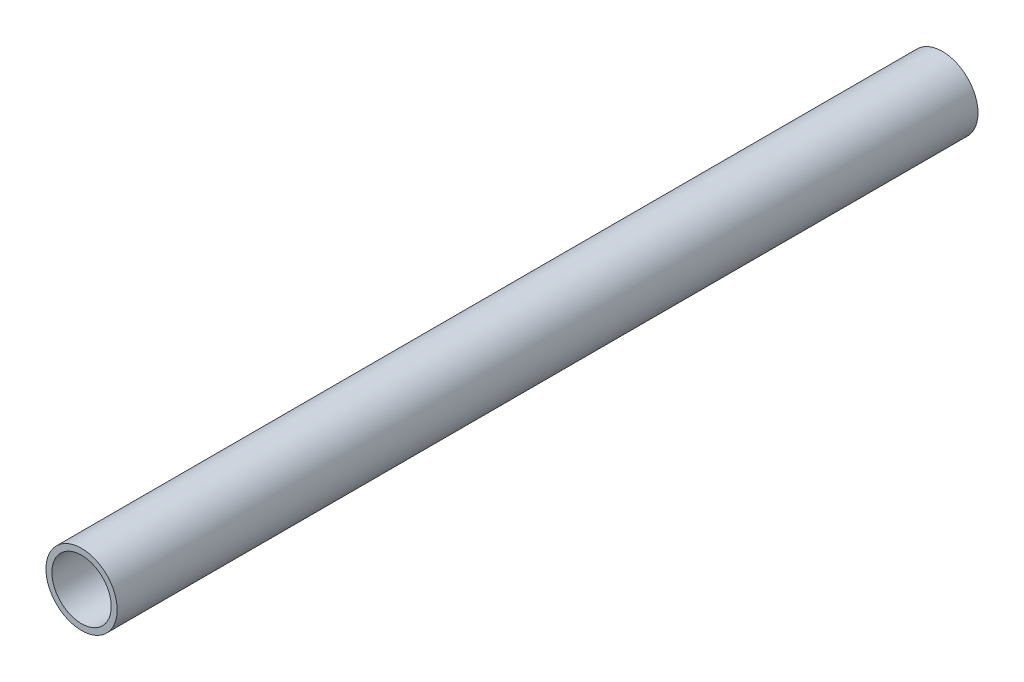
ISO-10303-21;
HEADER;
FILE_DESCRIPTION(('STEP AP214'),'2;1');
FILE_NAME('part.step','',(''),(''),'','','');
FILE_SCHEMA(('AUTOMOTIVE_DESIGN { 1 0 10303 214 1 1 1 1 }'));
ENDSEC;
DATA;
#1=APPLICATION_CONTEXT('core data for automotive mechanical design processes');
#2=APPLICATION_PROTOCOL_DEFINITION('international standard','automotive_design',2000,#1);
#3=PRODUCT_CONTEXT('',#1,'mechanical');
#4=PRODUCT('Part','Part','',(#3));
#5=PRODUCT_RELATED_PRODUCT_CATEGORY('part','',(#4));
#6=PRODUCT_DEFINITION_FORMATION('','',#4);
#7=PRODUCT_DEFINITION_CONTEXT('part definition',#1,'design');
#8=PRODUCT_DEFINITION('design','',#6,#7);
#9=PRODUCT_DEFINITION_SHAPE('','',#8);
#10=(LENGTH_UNIT() NAMED_UNIT(*) SI_UNIT(.MILLI.,.METRE.));
#11=(NAMED_UNIT(*) PLANE_ANGLE_UNIT() SI_UNIT($,.RADIAN.));
#12=(NAMED_UNIT(*) SI_UNIT($,.STERADIAN.) SOLID_ANGLE_UNIT());
#13=UNCERTAINTY_MEASURE_WITH_UNIT(LENGTH_MEASURE(1.E-05),#10,'distance_accuracy_value','');
#14=(GEOMETRIC_REPRESENTATION_CONTEXT(3) GLOBAL_UNCERTAINTY_ASSIGNED_CONTEXT((#13)) GLOBAL_UNIT_ASSIGNED_CONTEXT((#10,
#11,#12)) REPRESENTATION_CONTEXT('',''));
#15=CARTESIAN_POINT('',(0.,0.,0.));
#16=DIRECTION('',(0.,0.,1.));
#17=DIRECTION('',(1.,0.,0.));
#18=AXIS2_PLACEMENT_3D('',#15,#16,#17);
#19=CARTESIAN_POINT('',(-80.0000000000019,-58.0000000000001,145.));
#20=DIRECTION('',(0.,0.,1.));
#21=DIRECTION('',(1.,0.,0.));
#22=AXIS2_PLACEMENT_3D('',#19,#20,#21);
#23=PLANE('',#22);
#24=CARTESIAN_POINT('',(-80.0000000000019,-58.0000000000001,145.));
#25=DIRECTION('',(0.,0.,1.));
#26=DIRECTION('',(1.,0.,0.));
#27=AXIS2_PLACEMENT_3D('',#24,#25,#26);
#28=CIRCLE('',#27,6.);
#29=CARTESIAN_POINT('',(-74.0000000000019,-58.0000000000001,145.));
#30=VERTEX_POINT('',#29);
#31=EDGE_CURVE('E10',#30,#30,#28,.T.);
#32=ORIENTED_EDGE('',*,*,#31,.T.);
#33=EDGE_LOOP('',(#32));
#34=FACE_BOUND('',#33,.T.);
#35=CARTESIAN_POINT('',(-80.0000000000019,-58.0000000000001,145.));
#36=DIRECTION('',(0.,0.,1.));
#37=DIRECTION('',(1.,0.,0.));
#38=AXIS2_PLACEMENT_3D('',#35,#36,#37);
#39=CIRCLE('',#38,5.00000000000001);
#40=CARTESIAN_POINT('',(-75.0000000000019,-58.0000000000001,145.));
#41=VERTEX_POINT('',#40);
#42=EDGE_CURVE('E41',#41,#41,#39,.T.);
#43=ORIENTED_EDGE('',*,*,#42,.F.);
#44=EDGE_LOOP('',(#43));
#45=FACE_BOUND('',#44,.T.);
#46=ADVANCED_FACE('F30',(#34,#45),#23,.T.);
#47=CARTESIAN_POINT('',(-80.0000000000019,-58.0000000000001,0.));
#48=DIRECTION('',(0.,0.,1.));
#49=DIRECTION('',(1.,0.,0.));
#50=AXIS2_PLACEMENT_3D('',#47,#48,#49);
#51=PLANE('',#50);
#52=CARTESIAN_POINT('',(-80.0000000000019,-58.0000000000001,0.));
#53=DIRECTION('',(0.,0.,1.));
#54=DIRECTION('',(1.,0.,0.));
#55=AXIS2_PLACEMENT_3D('',#52,#53,#54);
#56=CIRCLE('',#55,6.);
#57=CARTESIAN_POINT('',(-74.0000000000019,-58.0000000000001,0.));
#58=VERTEX_POINT('',#57);
#59=EDGE_CURVE('E34',#58,#58,#56,.T.);
#60=ORIENTED_EDGE('',*,*,#59,.F.);
#61=EDGE_LOOP('',(#60));
#62=FACE_BOUND('',#61,.T.);
#63=CARTESIAN_POINT('',(-80.0000000000019,-58.0000000000001,0.));
#64=DIRECTION('',(0.,0.,1.));
#65=DIRECTION('',(1.,0.,0.));
#66=AXIS2_PLACEMENT_3D('',#63,#64,#65);
#67=CIRCLE('',#66,5.00000000000001);
#68=CARTESIAN_POINT('',(-75.0000000000019,-58.0000000000001,0.));
#69=VERTEX_POINT('',#68);
#70=EDGE_CURVE('E43',#69,#69,#67,.T.);
#71=ORIENTED_EDGE('',*,*,#70,.T.);
#72=EDGE_LOOP('',(#71));
#73=FACE_BOUND('',#72,.T.);
#74=ADVANCED_FACE('F53',(#62,#73),#51,.F.);
#75=CARTESIAN_POINT('',(-80.0000000000019,-58.0000000000001,145.));
#76=DIRECTION('',(0.,0.,-1.));
#77=DIRECTION('',(-1.,0.,0.));
#78=AXIS2_PLACEMENT_3D('',#75,#76,#77);
#79=CYLINDRICAL_SURFACE('',#78,6.);
#80=ORIENTED_EDGE('',*,*,#31,.F.);
#81=EDGE_LOOP('',(#80));
#82=FACE_BOUND('',#81,.T.);
#83=ORIENTED_EDGE('',*,*,#59,.T.);
#84=EDGE_LOOP('',(#83));
#85=FACE_BOUND('',#84,.T.);
#86=ADVANCED_FACE('F32',(#82,#85),#79,.T.);
#87=CARTESIAN_POINT('',(-80.0000000000019,-58.0000000000001,145.));
#88=DIRECTION('',(0.,0.,-1.));
#89=DIRECTION('',(-1.,0.,0.));
#90=AXIS2_PLACEMENT_3D('',#87,#88,#89);
#91=CYLINDRICAL_SURFACE('',#90,5.00000000000001);
#92=ORIENTED_EDGE('',*,*,#42,.T.);
#93=EDGE_LOOP('',(#92));
#94=FACE_BOUND('',#93,.T.);
#95=ORIENTED_EDGE('',*,*,#70,.F.);
#96=EDGE_LOOP('',(#95));
#97=FACE_BOUND('',#96,.T.);
#98=ADVANCED_FACE('F49',(#94,#97),#91,.F.);
#99=CLOSED_SHELL('',(#46,#74,#86,#98));
#100=MANIFOLD_SOLID_BREP('B2',#99);
#101=ADVANCED_BREP_SHAPE_REPRESENTATION('',(#18,#100),#14);
#102=SHAPE_DEFINITION_REPRESENTATION(#9,#101);
ENDSEC;
END-ISO-10303-21;
